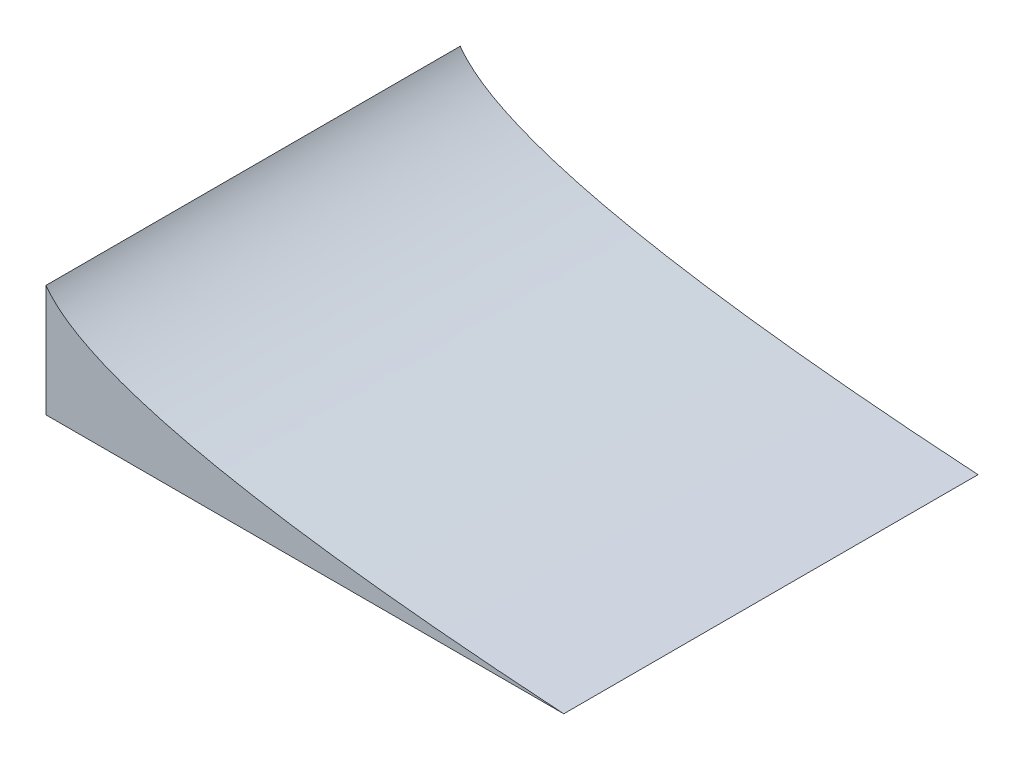
ISO-10303-21;
HEADER;
FILE_DESCRIPTION(('STEP AP214'),'2;1');
FILE_NAME('part.step','',(''),(''),'','','');
FILE_SCHEMA(('AUTOMOTIVE_DESIGN { 1 0 10303 214 1 1 1 1 }'));
ENDSEC;
DATA;
#1=APPLICATION_CONTEXT('core data for automotive mechanical design processes');
#2=APPLICATION_PROTOCOL_DEFINITION('international standard','automotive_design',2000,#1);
#3=PRODUCT_CONTEXT('',#1,'mechanical');
#4=PRODUCT('Part','Part','',(#3));
#5=PRODUCT_RELATED_PRODUCT_CATEGORY('part','',(#4));
#6=PRODUCT_DEFINITION_FORMATION('','',#4);
#7=PRODUCT_DEFINITION_CONTEXT('part definition',#1,'design');
#8=PRODUCT_DEFINITION('design','',#6,#7);
#9=PRODUCT_DEFINITION_SHAPE('','',#8);
#10=(LENGTH_UNIT() NAMED_UNIT(*) SI_UNIT(.MILLI.,.METRE.));
#11=(NAMED_UNIT(*) PLANE_ANGLE_UNIT() SI_UNIT($,.RADIAN.));
#12=(NAMED_UNIT(*) SI_UNIT($,.STERADIAN.) SOLID_ANGLE_UNIT());
#13=UNCERTAINTY_MEASURE_WITH_UNIT(LENGTH_MEASURE(1.E-05),#10,'distance_accuracy_value','');
#14=(GEOMETRIC_REPRESENTATION_CONTEXT(3) GLOBAL_UNCERTAINTY_ASSIGNED_CONTEXT((#13)) GLOBAL_UNIT_ASSIGNED_CONTEXT((#10,
#11,#12)) REPRESENTATION_CONTEXT('',''));
#15=CARTESIAN_POINT('',(0.,0.,0.));
#16=DIRECTION('',(0.,0.,1.));
#17=DIRECTION('',(1.,0.,0.));
#18=AXIS2_PLACEMENT_3D('',#15,#16,#17);
#19=CARTESIAN_POINT('',(381.,1.39977129142543E-13,-609.6));
#20=CARTESIAN_POINT('',(-296.003203858323,43.7119950107961,-609.6));
#21=CARTESIAN_POINT('',(-381.,165.1,-609.6));
#22=B_SPLINE_CURVE_WITH_KNOTS('',2,(#19,#20,#21),.UNSPECIFIED.,.F.,.F.,(3,3),(0.,1.),.UNSPECIFIED.);
#23=DIRECTION('',(0.,0.,1.));
#24=VECTOR('',#23,1.);
#25=SURFACE_OF_LINEAR_EXTRUSION('',#22,#24);
#26=CARTESIAN_POINT('',(381.,1.39977129142543E-13,0.));
#27=CARTESIAN_POINT('',(-296.003203858323,43.7119950107961,0.));
#28=CARTESIAN_POINT('',(-381.,165.1,0.));
#29=B_SPLINE_CURVE_WITH_KNOTS('',2,(#26,#27,#28),.UNSPECIFIED.,.F.,.F.,(3,3),(0.,1.),.UNSPECIFIED.);
#30=CARTESIAN_POINT('',(381.,1.39977129142543E-13,0.));
#31=VERTEX_POINT('',#30);
#32=CARTESIAN_POINT('',(-381.,165.1,0.));
#33=VERTEX_POINT('',#32);
#34=EDGE_CURVE('E109',#31,#33,#29,.T.);
#35=ORIENTED_EDGE('',*,*,#34,.F.);
#36=DIRECTION('',(0.,0.,1.));
#37=VECTOR('',#36,1.);
#38=CARTESIAN_POINT('',(381.,1.39977129142543E-13,-609.6));
#39=LINE('',#38,#37);
#40=CARTESIAN_POINT('',(381.,1.39977129142543E-13,-609.6));
#41=VERTEX_POINT('',#40);
#42=EDGE_CURVE('E11',#41,#31,#39,.T.);
#43=ORIENTED_EDGE('',*,*,#42,.F.);
#44=CARTESIAN_POINT('',(-381.,165.1,-609.6));
#45=VERTEX_POINT('',#44);
#46=EDGE_CURVE('E92',#41,#45,#22,.T.);
#47=ORIENTED_EDGE('',*,*,#46,.T.);
#48=DIRECTION('',(0.,0.,1.));
#49=VECTOR('',#48,1.);
#50=CARTESIAN_POINT('',(-381.,165.1,-609.6));
#51=LINE('',#50,#49);
#52=EDGE_CURVE('E49',#45,#33,#51,.T.);
#53=ORIENTED_EDGE('',*,*,#52,.T.);
#54=EDGE_LOOP('',(#35,#43,#47,#53));
#55=FACE_BOUND('',#54,.T.);
#56=ADVANCED_FACE('F45',(#55),#25,.T.);
#57=CARTESIAN_POINT('',(-381.,0.,-609.6));
#58=DIRECTION('',(0.,-1.,0.));
#59=DIRECTION('',(1.,0.,0.));
#60=AXIS2_PLACEMENT_3D('',#57,#58,#59);
#61=PLANE('',#60);
#62=DIRECTION('',(1.,0.,0.));
#63=VECTOR('',#62,1.);
#64=CARTESIAN_POINT('',(-381.,0.,0.));
#65=LINE('',#64,#63);
#66=CARTESIAN_POINT('',(-381.,0.,0.));
#67=VERTEX_POINT('',#66);
#68=EDGE_CURVE('E96',#67,#31,#65,.T.);
#69=ORIENTED_EDGE('',*,*,#68,.F.);
#70=DIRECTION('',(0.,0.,1.));
#71=VECTOR('',#70,1.);
#72=CARTESIAN_POINT('',(-381.,0.,-609.6));
#73=LINE('',#72,#71);
#74=CARTESIAN_POINT('',(-381.,0.,-609.6));
#75=VERTEX_POINT('',#74);
#76=EDGE_CURVE('E56',#75,#67,#73,.T.);
#77=ORIENTED_EDGE('',*,*,#76,.F.);
#78=DIRECTION('',(1.,0.,0.));
#79=VECTOR('',#78,1.);
#80=CARTESIAN_POINT('',(-381.,0.,-609.6));
#81=LINE('',#80,#79);
#82=EDGE_CURVE('E89',#75,#41,#81,.T.);
#83=ORIENTED_EDGE('',*,*,#82,.T.);
#84=ORIENTED_EDGE('',*,*,#42,.T.);
#85=EDGE_LOOP('',(#69,#77,#83,#84));
#86=FACE_BOUND('',#85,.T.);
#87=ADVANCED_FACE('F121',(#86),#61,.T.);
#88=CARTESIAN_POINT('',(-381.,0.,-609.6));
#89=DIRECTION('',(-1.,0.,0.));
#90=DIRECTION('',(0.,0.,1.));
#91=AXIS2_PLACEMENT_3D('',#88,#89,#90);
#92=PLANE('',#91);
#93=DIRECTION('',(0.,-1.,0.));
#94=VECTOR('',#93,1.);
#95=CARTESIAN_POINT('',(-381.,0.,0.));
#96=LINE('',#95,#94);
#97=EDGE_CURVE('E86',#33,#67,#96,.T.);
#98=ORIENTED_EDGE('',*,*,#97,.F.);
#99=ORIENTED_EDGE('',*,*,#52,.F.);
#100=DIRECTION('',(0.,-1.,0.));
#101=VECTOR('',#100,1.);
#102=CARTESIAN_POINT('',(-381.,0.,-609.6));
#103=LINE('',#102,#101);
#104=EDGE_CURVE('E84',#45,#75,#103,.T.);
#105=ORIENTED_EDGE('',*,*,#104,.T.);
#106=ORIENTED_EDGE('',*,*,#76,.T.);
#107=EDGE_LOOP('',(#98,#99,#105,#106));
#108=FACE_BOUND('',#107,.T.);
#109=ADVANCED_FACE('F83',(#108),#92,.T.);
#110=CARTESIAN_POINT('',(-148.001601929161,63.1309975053981,-609.6));
#111=DIRECTION('',(0.,0.,-1.));
#112=DIRECTION('',(-1.,0.,0.));
#113=AXIS2_PLACEMENT_3D('',#110,#111,#112);
#114=PLANE('',#113);
#115=ORIENTED_EDGE('',*,*,#46,.F.);
#116=ORIENTED_EDGE('',*,*,#82,.F.);
#117=ORIENTED_EDGE('',*,*,#104,.F.);
#118=EDGE_LOOP('',(#115,#116,#117));
#119=FACE_BOUND('',#118,.T.);
#120=ADVANCED_FACE('F91',(#119),#114,.T.);
#121=CARTESIAN_POINT('',(-148.001601929161,63.1309975053981,0.));
#122=DIRECTION('',(0.,0.,-1.));
#123=DIRECTION('',(-1.,0.,0.));
#124=AXIS2_PLACEMENT_3D('',#121,#122,#123);
#125=PLANE('',#124);
#126=ORIENTED_EDGE('',*,*,#34,.T.);
#127=ORIENTED_EDGE('',*,*,#97,.T.);
#128=ORIENTED_EDGE('',*,*,#68,.T.);
#129=EDGE_LOOP('',(#126,#127,#128));
#130=FACE_BOUND('',#129,.T.);
#131=ADVANCED_FACE('F120',(#130),#125,.F.);
#132=CLOSED_SHELL('',(#56,#87,#109,#120,#131));
#133=MANIFOLD_SOLID_BREP('B2',#132);
#134=ADVANCED_BREP_SHAPE_REPRESENTATION('',(#18,#133),#14);
#135=SHAPE_DEFINITION_REPRESENTATION(#9,#134);
ENDSEC;
END-ISO-10303-21;
